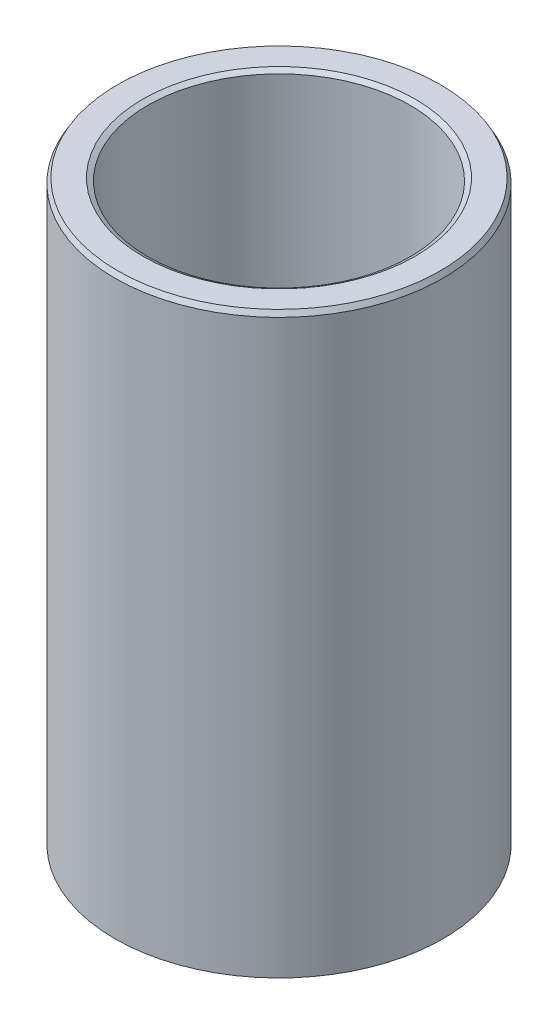
ISO-10303-21;
HEADER;
FILE_DESCRIPTION(('STEP AP214'),'2;1');
FILE_NAME('part.step','',(''),(''),'','','');
FILE_SCHEMA(('AUTOMOTIVE_DESIGN { 1 0 10303 214 1 1 1 1 }'));
ENDSEC;
DATA;
#1=APPLICATION_CONTEXT('core data for automotive mechanical design processes');
#2=APPLICATION_PROTOCOL_DEFINITION('international standard','automotive_design',2000,#1);
#3=PRODUCT_CONTEXT('',#1,'mechanical');
#4=PRODUCT('Part','Part','',(#3));
#5=PRODUCT_RELATED_PRODUCT_CATEGORY('part','',(#4));
#6=PRODUCT_DEFINITION_FORMATION('','',#4);
#7=PRODUCT_DEFINITION_CONTEXT('part definition',#1,'design');
#8=PRODUCT_DEFINITION('design','',#6,#7);
#9=PRODUCT_DEFINITION_SHAPE('','',#8);
#10=(LENGTH_UNIT() NAMED_UNIT(*) SI_UNIT(.MILLI.,.METRE.));
#11=(NAMED_UNIT(*) PLANE_ANGLE_UNIT() SI_UNIT($,.RADIAN.));
#12=(NAMED_UNIT(*) SI_UNIT($,.STERADIAN.) SOLID_ANGLE_UNIT());
#13=UNCERTAINTY_MEASURE_WITH_UNIT(LENGTH_MEASURE(1.E-05),#10,'distance_accuracy_value','');
#14=(GEOMETRIC_REPRESENTATION_CONTEXT(3) GLOBAL_UNCERTAINTY_ASSIGNED_CONTEXT((#13)) GLOBAL_UNIT_ASSIGNED_CONTEXT((#10,
#11,#12)) REPRESENTATION_CONTEXT('',''));
#15=CARTESIAN_POINT('',(0.,0.,0.));
#16=DIRECTION('',(0.,0.,1.));
#17=DIRECTION('',(1.,0.,0.));
#18=AXIS2_PLACEMENT_3D('',#15,#16,#17);
#19=CARTESIAN_POINT('',(0.,167.787291729594,0.));
#20=DIRECTION('',(0.,-1.,0.));
#21=DIRECTION('',(0.,0.,-1.));
#22=AXIS2_PLACEMENT_3D('',#19,#20,#21);
#23=CYLINDRICAL_SURFACE('',#22,47.5);
#24=CARTESIAN_POINT('',(0.,0.824718856437728,0.));
#25=DIRECTION('',(0.,1.,0.));
#26=DIRECTION('',(0.,0.,1.));
#27=AXIS2_PLACEMENT_3D('',#24,#25,#26);
#28=CIRCLE('',#27,47.5);
#29=CARTESIAN_POINT('',(0.,0.824718856437728,47.5));
#30=VERTEX_POINT('',#29);
#31=EDGE_CURVE('E10',#30,#30,#28,.T.);
#32=ORIENTED_EDGE('',*,*,#31,.T.);
#33=EDGE_LOOP('',(#32));
#34=FACE_BOUND('',#33,.T.);
#35=CARTESIAN_POINT('',(0.,166.358836768284,0.));
#36=DIRECTION('',(0.,1.,0.));
#37=DIRECTION('',(0.,0.,1.));
#38=AXIS2_PLACEMENT_3D('',#35,#36,#37);
#39=CIRCLE('',#38,47.5);
#40=CARTESIAN_POINT('',(0.,166.358836768284,47.5));
#41=VERTEX_POINT('',#40);
#42=EDGE_CURVE('E50',#41,#41,#39,.F.);
#43=ORIENTED_EDGE('',*,*,#42,.T.);
#44=EDGE_LOOP('',(#43));
#45=FACE_BOUND('',#44,.T.);
#46=ADVANCED_FACE('F39',(#34,#45),#23,.T.);
#47=CARTESIAN_POINT('',(0.,167.787291729594,0.));
#48=DIRECTION('',(0.,1.,0.));
#49=DIRECTION('',(0.,0.,1.));
#50=AXIS2_PLACEMENT_3D('',#47,#48,#49);
#51=PLANE('',#50);
#52=CARTESIAN_POINT('',(0.,167.787291729594,0.));
#53=DIRECTION('',(0.,1.,0.));
#54=DIRECTION('',(0.,0.,1.));
#55=AXIS2_PLACEMENT_3D('',#52,#53,#54);
#56=CIRCLE('',#55,39.3970636703632);
#57=CARTESIAN_POINT('',(0.,167.787291729594,39.3970636703632));
#58=VERTEX_POINT('',#57);
#59=EDGE_CURVE('E58',#58,#58,#56,.F.);
#60=ORIENTED_EDGE('',*,*,#59,.T.);
#61=EDGE_LOOP('',(#60));
#62=FACE_BOUND('',#61,.T.);
#63=CARTESIAN_POINT('',(0.,167.787291729594,0.));
#64=DIRECTION('',(0.,1.,0.));
#65=DIRECTION('',(0.,0.,1.));
#66=AXIS2_PLACEMENT_3D('',#63,#64,#65);
#67=CIRCLE('',#66,46.6752811435622);
#68=CARTESIAN_POINT('',(0.,167.787291729594,46.6752811435622));
#69=VERTEX_POINT('',#68);
#70=EDGE_CURVE('E61',#69,#69,#67,.T.);
#71=ORIENTED_EDGE('',*,*,#70,.T.);
#72=EDGE_LOOP('',(#71));
#73=FACE_BOUND('',#72,.T.);
#74=ADVANCED_FACE('F88',(#62,#73),#51,.T.);
#75=CARTESIAN_POINT('',(0.,0.,0.));
#76=DIRECTION('',(0.,1.,0.));
#77=DIRECTION('',(0.,0.,1.));
#78=AXIS2_PLACEMENT_3D('',#75,#76,#77);
#79=PLANE('',#78);
#80=CARTESIAN_POINT('',(0.,0.,0.));
#81=DIRECTION('',(0.,1.,0.));
#82=DIRECTION('',(0.,0.,1.));
#83=AXIS2_PLACEMENT_3D('',#80,#81,#82);
#84=CIRCLE('',#83,38.7933275654906);
#85=CARTESIAN_POINT('',(0.,0.,38.7933275654906));
#86=VERTEX_POINT('',#85);
#87=EDGE_CURVE('E51',#86,#86,#84,.T.);
#88=ORIENTED_EDGE('',*,*,#87,.T.);
#89=EDGE_LOOP('',(#88));
#90=FACE_BOUND('',#89,.T.);
#91=CARTESIAN_POINT('',(0.,0.,0.));
#92=DIRECTION('',(0.,1.,0.));
#93=DIRECTION('',(0.,0.,1.));
#94=AXIS2_PLACEMENT_3D('',#91,#92,#93);
#95=CIRCLE('',#94,46.0715450386897);
#96=CARTESIAN_POINT('',(0.,0.,46.0715450386897));
#97=VERTEX_POINT('',#96);
#98=EDGE_CURVE('E54',#97,#97,#95,.F.);
#99=ORIENTED_EDGE('',*,*,#98,.T.);
#100=EDGE_LOOP('',(#99));
#101=FACE_BOUND('',#100,.T.);
#102=ADVANCED_FACE('F83',(#90,#101),#79,.F.);
#103=CARTESIAN_POINT('',(0.,167.787291729594,0.));
#104=DIRECTION('',(0.,-1.,0.));
#105=DIRECTION('',(0.,0.,-1.));
#106=AXIS2_PLACEMENT_3D('',#103,#104,#105);
#107=CYLINDRICAL_SURFACE('',#106,37.9686087090529);
#108=CARTESIAN_POINT('',(0.,166.962572873157,0.));
#109=DIRECTION('',(0.,1.,0.));
#110=DIRECTION('',(0.,0.,1.));
#111=AXIS2_PLACEMENT_3D('',#108,#109,#110);
#112=CIRCLE('',#111,37.9686087090529);
#113=CARTESIAN_POINT('',(0.,166.962572873157,37.9686087090529));
#114=VERTEX_POINT('',#113);
#115=EDGE_CURVE('E67',#114,#114,#112,.T.);
#116=ORIENTED_EDGE('',*,*,#115,.T.);
#117=EDGE_LOOP('',(#116));
#118=FACE_BOUND('',#117,.T.);
#119=CARTESIAN_POINT('',(0.,1.42845496131036,0.));
#120=DIRECTION('',(0.,1.,0.));
#121=DIRECTION('',(0.,0.,1.));
#122=AXIS2_PLACEMENT_3D('',#119,#120,#121);
#123=CIRCLE('',#122,37.9686087090529);
#124=CARTESIAN_POINT('',(0.,1.42845496131036,37.9686087090529));
#125=VERTEX_POINT('',#124);
#126=EDGE_CURVE('E69',#125,#125,#123,.F.);
#127=ORIENTED_EDGE('',*,*,#126,.T.);
#128=EDGE_LOOP('',(#127));
#129=FACE_BOUND('',#128,.T.);
#130=ADVANCED_FACE('F71',(#118,#129),#107,.F.);
#131=CARTESIAN_POINT('',(0.,166.962572873157,0.));
#132=DIRECTION('',(0.,1.,0.));
#133=DIRECTION('',(0.,0.,1.));
#134=AXIS2_PLACEMENT_3D('',#131,#132,#133);
#135=CONICAL_SURFACE('',#134,37.9686087090529,1.0471975511966);
#136=ORIENTED_EDGE('',*,*,#59,.F.);
#137=EDGE_LOOP('',(#136));
#138=FACE_BOUND('',#137,.T.);
#139=ORIENTED_EDGE('',*,*,#115,.F.);
#140=EDGE_LOOP('',(#139));
#141=FACE_BOUND('',#140,.T.);
#142=ADVANCED_FACE('F77',(#138,#141),#135,.F.);
#143=CARTESIAN_POINT('',(0.,0.,0.));
#144=DIRECTION('',(0.,-1.,0.));
#145=DIRECTION('',(0.,0.,-1.));
#146=AXIS2_PLACEMENT_3D('',#143,#144,#145);
#147=CONICAL_SURFACE('',#146,38.7933275654906,0.523598775598287);
#148=ORIENTED_EDGE('',*,*,#126,.F.);
#149=EDGE_LOOP('',(#148));
#150=FACE_BOUND('',#149,.T.);
#151=ORIENTED_EDGE('',*,*,#87,.F.);
#152=EDGE_LOOP('',(#151));
#153=FACE_BOUND('',#152,.T.);
#154=ADVANCED_FACE('F73',(#150,#153),#147,.F.);
#155=CARTESIAN_POINT('',(0.,0.824718856437728,0.));
#156=DIRECTION('',(0.,1.,0.));
#157=DIRECTION('',(0.,0.,1.));
#158=AXIS2_PLACEMENT_3D('',#155,#156,#157);
#159=CONICAL_SURFACE('',#158,47.5,1.0471975511966);
#160=ORIENTED_EDGE('',*,*,#98,.F.);
#161=EDGE_LOOP('',(#160));
#162=FACE_BOUND('',#161,.T.);
#163=ORIENTED_EDGE('',*,*,#31,.F.);
#164=EDGE_LOOP('',(#163));
#165=FACE_BOUND('',#164,.T.);
#166=ADVANCED_FACE('F76',(#162,#165),#159,.T.);
#167=CARTESIAN_POINT('',(0.,167.787291729594,0.));
#168=DIRECTION('',(0.,-1.,0.));
#169=DIRECTION('',(0.,0.,-1.));
#170=AXIS2_PLACEMENT_3D('',#167,#168,#169);
#171=CONICAL_SURFACE('',#170,46.6752811435622,0.523598775598298);
#172=ORIENTED_EDGE('',*,*,#42,.F.);
#173=EDGE_LOOP('',(#172));
#174=FACE_BOUND('',#173,.T.);
#175=ORIENTED_EDGE('',*,*,#70,.F.);
#176=EDGE_LOOP('',(#175));
#177=FACE_BOUND('',#176,.T.);
#178=ADVANCED_FACE('F45',(#174,#177),#171,.T.);
#179=CLOSED_SHELL('',(#46,#74,#102,#130,#142,#154,#166,#178));
#180=MANIFOLD_SOLID_BREP('B2',#179);
#181=ADVANCED_BREP_SHAPE_REPRESENTATION('',(#18,#180),#14);
#182=SHAPE_DEFINITION_REPRESENTATION(#9,#181);
ENDSEC;
END-ISO-10303-21;
